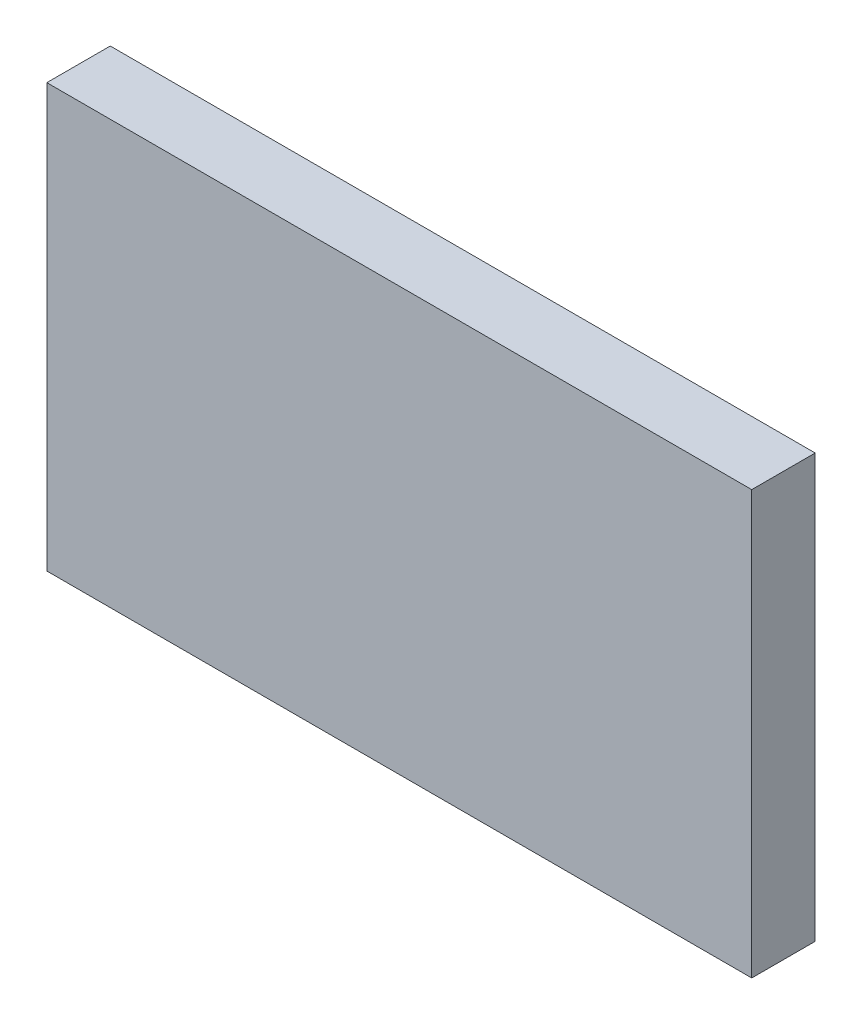
ISO-10303-21;
HEADER;
FILE_DESCRIPTION(('STEP AP214'),'2;1');
FILE_NAME('part.step','',(''),(''),'','','');
FILE_SCHEMA(('AUTOMOTIVE_DESIGN { 1 0 10303 214 1 1 1 1 }'));
ENDSEC;
DATA;
#1=APPLICATION_CONTEXT('core data for automotive mechanical design processes');
#2=APPLICATION_PROTOCOL_DEFINITION('international standard','automotive_design',2000,#1);
#3=PRODUCT_CONTEXT('',#1,'mechanical');
#4=PRODUCT('Part','Part','',(#3));
#5=PRODUCT_RELATED_PRODUCT_CATEGORY('part','',(#4));
#6=PRODUCT_DEFINITION_FORMATION('','',#4);
#7=PRODUCT_DEFINITION_CONTEXT('part definition',#1,'design');
#8=PRODUCT_DEFINITION('design','',#6,#7);
#9=PRODUCT_DEFINITION_SHAPE('','',#8);
#10=(LENGTH_UNIT() NAMED_UNIT(*) SI_UNIT(.MILLI.,.METRE.));
#11=(NAMED_UNIT(*) PLANE_ANGLE_UNIT() SI_UNIT($,.RADIAN.));
#12=(NAMED_UNIT(*) SI_UNIT($,.STERADIAN.) SOLID_ANGLE_UNIT());
#13=UNCERTAINTY_MEASURE_WITH_UNIT(LENGTH_MEASURE(1.E-05),#10,'distance_accuracy_value','');
#14=(GEOMETRIC_REPRESENTATION_CONTEXT(3) GLOBAL_UNCERTAINTY_ASSIGNED_CONTEXT((#13)) GLOBAL_UNIT_ASSIGNED_CONTEXT((#10,
#11,#12)) REPRESENTATION_CONTEXT('',''));
#15=CARTESIAN_POINT('',(0.,0.,0.));
#16=DIRECTION('',(0.,0.,1.));
#17=DIRECTION('',(1.,0.,0.));
#18=AXIS2_PLACEMENT_3D('',#15,#16,#17);
#19=CARTESIAN_POINT('',(-33.8568935427574,31.413612565445,9.));
#20=DIRECTION('',(1.,0.,0.));
#21=DIRECTION('',(0.,1.,0.));
#22=AXIS2_PLACEMENT_3D('',#19,#20,#21);
#23=PLANE('',#22);
#24=DIRECTION('',(0.,-1.,0.));
#25=VECTOR('',#24,1.);
#26=CARTESIAN_POINT('',(-33.8568935427574,31.413612565445,0.));
#27=LINE('',#26,#25);
#28=CARTESIAN_POINT('',(-33.8568935427574,31.413612565445,0.));
#29=VERTEX_POINT('',#28);
#30=CARTESIAN_POINT('',(-33.8568935427574,-28.586387434555,0.));
#31=VERTEX_POINT('',#30);
#32=EDGE_CURVE('E107',#29,#31,#27,.T.);
#33=ORIENTED_EDGE('',*,*,#32,.T.);
#34=DIRECTION('',(0.,0.,-1.));
#35=VECTOR('',#34,1.);
#36=CARTESIAN_POINT('',(-33.8568935427574,-28.586387434555,9.));
#37=LINE('',#36,#35);
#38=CARTESIAN_POINT('',(-33.8568935427574,-28.586387434555,9.));
#39=VERTEX_POINT('',#38);
#40=EDGE_CURVE('E11',#39,#31,#37,.T.);
#41=ORIENTED_EDGE('',*,*,#40,.F.);
#42=DIRECTION('',(0.,-1.,0.));
#43=VECTOR('',#42,1.);
#44=CARTESIAN_POINT('',(-33.8568935427574,31.413612565445,9.));
#45=LINE('',#44,#43);
#46=CARTESIAN_POINT('',(-33.8568935427574,31.413612565445,9.));
#47=VERTEX_POINT('',#46);
#48=EDGE_CURVE('E91',#47,#39,#45,.T.);
#49=ORIENTED_EDGE('',*,*,#48,.F.);
#50=DIRECTION('',(0.,0.,-1.));
#51=VECTOR('',#50,1.);
#52=CARTESIAN_POINT('',(-33.8568935427574,31.413612565445,9.));
#53=LINE('',#52,#51);
#54=EDGE_CURVE('E103',#47,#29,#53,.T.);
#55=ORIENTED_EDGE('',*,*,#54,.T.);
#56=EDGE_LOOP('',(#33,#41,#49,#55));
#57=FACE_BOUND('',#56,.T.);
#58=ADVANCED_FACE('F39',(#57),#23,.F.);
#59=CARTESIAN_POINT('',(-33.8568935427574,-28.586387434555,9.));
#60=DIRECTION('',(0.,1.,0.));
#61=DIRECTION('',(0.,0.,1.));
#62=AXIS2_PLACEMENT_3D('',#59,#60,#61);
#63=PLANE('',#62);
#64=DIRECTION('',(1.,0.,0.));
#65=VECTOR('',#64,1.);
#66=CARTESIAN_POINT('',(-33.8568935427574,-28.586387434555,0.));
#67=LINE('',#66,#65);
#68=CARTESIAN_POINT('',(66.1431064572426,-28.586387434555,0.));
#69=VERTEX_POINT('',#68);
#70=EDGE_CURVE('E96',#31,#69,#67,.T.);
#71=ORIENTED_EDGE('',*,*,#70,.T.);
#72=DIRECTION('',(0.,0.,-1.));
#73=VECTOR('',#72,1.);
#74=CARTESIAN_POINT('',(66.1431064572426,-28.586387434555,9.));
#75=LINE('',#74,#73);
#76=CARTESIAN_POINT('',(66.1431064572426,-28.586387434555,9.));
#77=VERTEX_POINT('',#76);
#78=EDGE_CURVE('E48',#77,#69,#75,.T.);
#79=ORIENTED_EDGE('',*,*,#78,.F.);
#80=DIRECTION('',(1.,0.,0.));
#81=VECTOR('',#80,1.);
#82=CARTESIAN_POINT('',(-33.8568935427574,-28.586387434555,9.));
#83=LINE('',#82,#81);
#84=EDGE_CURVE('E86',#39,#77,#83,.T.);
#85=ORIENTED_EDGE('',*,*,#84,.F.);
#86=ORIENTED_EDGE('',*,*,#40,.T.);
#87=EDGE_LOOP('',(#71,#79,#85,#86));
#88=FACE_BOUND('',#87,.T.);
#89=ADVANCED_FACE('F95',(#88),#63,.F.);
#90=CARTESIAN_POINT('',(66.1431064572426,31.413612565445,9.));
#91=DIRECTION('',(-1.,0.,0.));
#92=DIRECTION('',(0.,0.,1.));
#93=AXIS2_PLACEMENT_3D('',#90,#91,#92);
#94=PLANE('',#93);
#95=DIRECTION('',(0.,1.,0.));
#96=VECTOR('',#95,1.);
#97=CARTESIAN_POINT('',(66.1431064572426,31.413612565445,0.));
#98=LINE('',#97,#96);
#99=CARTESIAN_POINT('',(66.1431064572426,31.413612565445,0.));
#100=VERTEX_POINT('',#99);
#101=EDGE_CURVE('E73',#69,#100,#98,.T.);
#102=ORIENTED_EDGE('',*,*,#101,.T.);
#103=DIRECTION('',(0.,0.,-1.));
#104=VECTOR('',#103,1.);
#105=CARTESIAN_POINT('',(66.1431064572426,31.413612565445,9.));
#106=LINE('',#105,#104);
#107=CARTESIAN_POINT('',(66.1431064572426,31.413612565445,9.));
#108=VERTEX_POINT('',#107);
#109=EDGE_CURVE('E98',#108,#100,#106,.T.);
#110=ORIENTED_EDGE('',*,*,#109,.F.);
#111=DIRECTION('',(0.,1.,0.));
#112=VECTOR('',#111,1.);
#113=CARTESIAN_POINT('',(66.1431064572426,31.413612565445,9.));
#114=LINE('',#113,#112);
#115=EDGE_CURVE('E89',#77,#108,#114,.T.);
#116=ORIENTED_EDGE('',*,*,#115,.F.);
#117=ORIENTED_EDGE('',*,*,#78,.T.);
#118=EDGE_LOOP('',(#102,#110,#116,#117));
#119=FACE_BOUND('',#118,.T.);
#120=ADVANCED_FACE('F99',(#119),#94,.F.);
#121=CARTESIAN_POINT('',(-33.8568935427574,31.413612565445,9.));
#122=DIRECTION('',(0.,-1.,0.));
#123=DIRECTION('',(0.,0.,-1.));
#124=AXIS2_PLACEMENT_3D('',#121,#122,#123);
#125=PLANE('',#124);
#126=DIRECTION('',(-1.,0.,0.));
#127=VECTOR('',#126,1.);
#128=CARTESIAN_POINT('',(-33.8568935427574,31.413612565445,0.));
#129=LINE('',#128,#127);
#130=EDGE_CURVE('E79',#100,#29,#129,.T.);
#131=ORIENTED_EDGE('',*,*,#130,.T.);
#132=ORIENTED_EDGE('',*,*,#54,.F.);
#133=DIRECTION('',(-1.,0.,0.));
#134=VECTOR('',#133,1.);
#135=CARTESIAN_POINT('',(-33.8568935427574,31.413612565445,9.));
#136=LINE('',#135,#134);
#137=EDGE_CURVE('E56',#108,#47,#136,.T.);
#138=ORIENTED_EDGE('',*,*,#137,.F.);
#139=ORIENTED_EDGE('',*,*,#109,.T.);
#140=EDGE_LOOP('',(#131,#132,#138,#139));
#141=FACE_BOUND('',#140,.T.);
#142=ADVANCED_FACE('F120',(#141),#125,.F.);
#143=CARTESIAN_POINT('',(0.,0.,9.));
#144=DIRECTION('',(0.,0.,1.));
#145=DIRECTION('',(1.,0.,0.));
#146=AXIS2_PLACEMENT_3D('',#143,#144,#145);
#147=PLANE('',#146);
#148=ORIENTED_EDGE('',*,*,#48,.T.);
#149=ORIENTED_EDGE('',*,*,#84,.T.);
#150=ORIENTED_EDGE('',*,*,#115,.T.);
#151=ORIENTED_EDGE('',*,*,#137,.T.);
#152=EDGE_LOOP('',(#148,#149,#150,#151));
#153=FACE_BOUND('',#152,.T.);
#154=ADVANCED_FACE('F87',(#153),#147,.T.);
#155=CARTESIAN_POINT('',(0.,0.,0.));
#156=DIRECTION('',(0.,0.,1.));
#157=DIRECTION('',(1.,0.,0.));
#158=AXIS2_PLACEMENT_3D('',#155,#156,#157);
#159=PLANE('',#158);
#160=ORIENTED_EDGE('',*,*,#32,.F.);
#161=ORIENTED_EDGE('',*,*,#130,.F.);
#162=ORIENTED_EDGE('',*,*,#101,.F.);
#163=ORIENTED_EDGE('',*,*,#70,.F.);
#164=EDGE_LOOP('',(#160,#161,#162,#163));
#165=FACE_BOUND('',#164,.T.);
#166=ADVANCED_FACE('F123',(#165),#159,.F.);
#167=CLOSED_SHELL('',(#58,#89,#120,#142,#154,#166));
#168=MANIFOLD_SOLID_BREP('B2',#167);
#169=ADVANCED_BREP_SHAPE_REPRESENTATION('',(#18,#168),#14);
#170=SHAPE_DEFINITION_REPRESENTATION(#9,#169);
ENDSEC;
END-ISO-10303-21;
